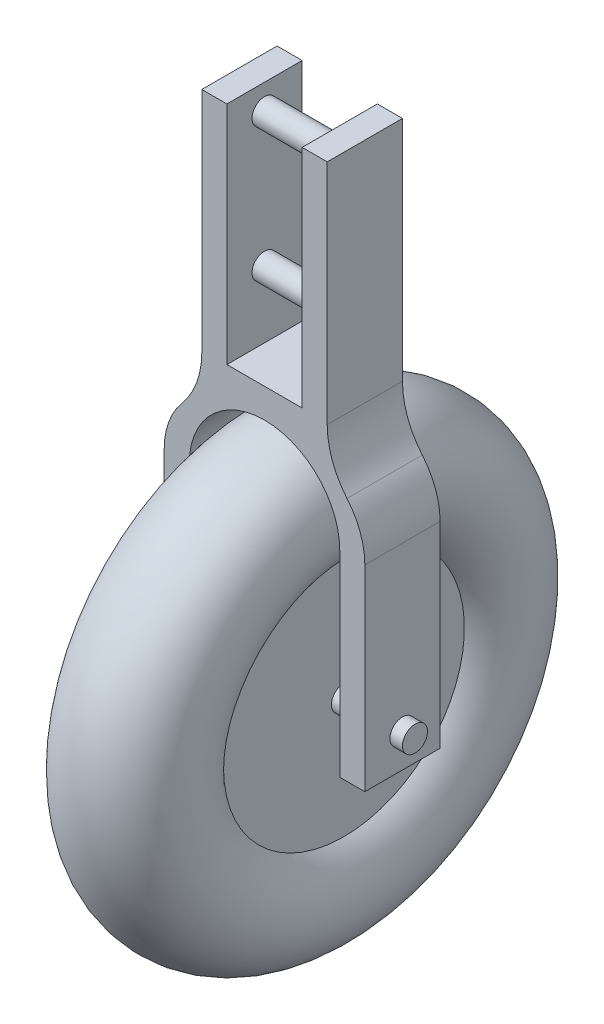
ISO-10303-21;
HEADER;
FILE_DESCRIPTION(('STEP AP214'),'2;1');
FILE_NAME('part.step','',(''),(''),'','','');
FILE_SCHEMA(('AUTOMOTIVE_DESIGN { 1 0 10303 214 1 1 1 1 }'));
ENDSEC;
DATA;
#1=APPLICATION_CONTEXT('core data for automotive mechanical design processes');
#2=APPLICATION_PROTOCOL_DEFINITION('international standard','automotive_design',2000,#1);
#3=PRODUCT_CONTEXT('',#1,'mechanical');
#4=PRODUCT('Part','Part','',(#3));
#5=PRODUCT_RELATED_PRODUCT_CATEGORY('part','',(#4));
#6=PRODUCT_DEFINITION_FORMATION('','',#4);
#7=PRODUCT_DEFINITION_CONTEXT('part definition',#1,'design');
#8=PRODUCT_DEFINITION('design','',#6,#7);
#9=PRODUCT_DEFINITION_SHAPE('','',#8);
#10=(LENGTH_UNIT() NAMED_UNIT(*) SI_UNIT(.MILLI.,.METRE.));
#11=(NAMED_UNIT(*) PLANE_ANGLE_UNIT() SI_UNIT($,.RADIAN.));
#12=(NAMED_UNIT(*) SI_UNIT($,.STERADIAN.) SOLID_ANGLE_UNIT());
#13=UNCERTAINTY_MEASURE_WITH_UNIT(LENGTH_MEASURE(1.E-05),#10,'distance_accuracy_value','');
#14=(GEOMETRIC_REPRESENTATION_CONTEXT(3) GLOBAL_UNCERTAINTY_ASSIGNED_CONTEXT((#13)) GLOBAL_UNIT_ASSIGNED_CONTEXT((#10,
#11,#12)) REPRESENTATION_CONTEXT('',''));
#15=CARTESIAN_POINT('',(0.,0.,0.));
#16=DIRECTION('',(0.,0.,1.));
#17=DIRECTION('',(1.,0.,0.));
#18=AXIS2_PLACEMENT_3D('',#15,#16,#17);
#19=CARTESIAN_POINT('',(13.5,-32.,4.5));
#20=DIRECTION('',(-1.,0.,0.));
#21=DIRECTION('',(0.,0.,1.));
#22=AXIS2_PLACEMENT_3D('',#19,#20,#21);
#23=CYLINDRICAL_SURFACE('',#22,1.5);
#24=CARTESIAN_POINT('',(9.,-32.,4.5));
#25=DIRECTION('',(1.,0.,0.));
#26=DIRECTION('',(0.,1.,0.));
#27=AXIS2_PLACEMENT_3D('',#24,#25,#26);
#28=CIRCLE('',#27,1.5);
#29=CARTESIAN_POINT('',(9.,-30.5,4.5));
#30=VERTEX_POINT('',#29);
#31=EDGE_CURVE('E279',#30,#30,#28,.F.);
#32=ORIENTED_EDGE('',*,*,#31,.T.);
#33=EDGE_LOOP('',(#32));
#34=FACE_BOUND('',#33,.T.);
#35=CARTESIAN_POINT('',(5.,-32.,4.5));
#36=DIRECTION('',(-1.,0.,0.));
#37=DIRECTION('',(0.,0.,1.));
#38=AXIS2_PLACEMENT_3D('',#35,#36,#37);
#39=CIRCLE('',#38,1.5);
#40=CARTESIAN_POINT('',(5.,-32.,6.));
#41=VERTEX_POINT('',#40);
#42=EDGE_CURVE('E11',#41,#41,#39,.T.);
#43=ORIENTED_EDGE('',*,*,#42,.F.);
#44=EDGE_LOOP('',(#43));
#45=FACE_BOUND('',#44,.T.);
#46=ADVANCED_FACE('F36',(#34,#45),#23,.T.);
#47=CARTESIAN_POINT('',(-7.5,27.,9.));
#48=DIRECTION('',(1.,0.,0.));
#49=DIRECTION('',(0.,1.,0.));
#50=AXIS2_PLACEMENT_3D('',#47,#48,#49);
#51=PLANE('',#50);
#52=DIRECTION('',(0.,-1.,0.));
#53=VECTOR('',#52,1.);
#54=CARTESIAN_POINT('',(-7.5,27.,0.));
#55=LINE('',#54,#53);
#56=CARTESIAN_POINT('',(-7.5,27.,0.));
#57=VERTEX_POINT('',#56);
#58=CARTESIAN_POINT('',(-7.5,-0.221970842191317,0.));
#59=VERTEX_POINT('',#58);
#60=EDGE_CURVE('E196',#57,#59,#55,.T.);
#61=ORIENTED_EDGE('',*,*,#60,.T.);
#62=DIRECTION('',(0.,0.,-1.));
#63=VECTOR('',#62,1.);
#64=CARTESIAN_POINT('',(-7.5,-0.221970842191317,9.));
#65=LINE('',#64,#63);
#66=CARTESIAN_POINT('',(-7.5,-0.221970842191317,9.));
#67=VERTEX_POINT('',#66);
#68=EDGE_CURVE('E275',#67,#59,#65,.T.);
#69=ORIENTED_EDGE('',*,*,#68,.F.);
#70=DIRECTION('',(0.,-1.,0.));
#71=VECTOR('',#70,1.);
#72=CARTESIAN_POINT('',(-7.5,27.,9.));
#73=LINE('',#72,#71);
#74=CARTESIAN_POINT('',(-7.5,27.,9.));
#75=VERTEX_POINT('',#74);
#76=EDGE_CURVE('E232',#75,#67,#73,.T.);
#77=ORIENTED_EDGE('',*,*,#76,.F.);
#78=DIRECTION('',(0.,0.,-1.));
#79=VECTOR('',#78,1.);
#80=CARTESIAN_POINT('',(-7.5,27.,9.));
#81=LINE('',#80,#79);
#82=EDGE_CURVE('E192',#75,#57,#81,.T.);
#83=ORIENTED_EDGE('',*,*,#82,.T.);
#84=EDGE_LOOP('',(#61,#69,#77,#83));
#85=FACE_BOUND('',#84,.T.);
#86=ADVANCED_FACE('F38',(#85),#51,.F.);
#87=CARTESIAN_POINT('',(-17.5,-0.221970842191319,9.));
#88=DIRECTION('',(0.,0.,-1.));
#89=DIRECTION('',(-1.,0.,0.));
#90=AXIS2_PLACEMENT_3D('',#87,#88,#89);
#91=CYLINDRICAL_SURFACE('',#90,10.);
#92=CARTESIAN_POINT('',(-17.5,-0.221970842191319,0.));
#93=DIRECTION('',(0.,0.,-1.));
#94=DIRECTION('',(-1.,0.,0.));
#95=AXIS2_PLACEMENT_3D('',#92,#93,#94);
#96=CIRCLE('',#95,10.);
#97=CARTESIAN_POINT('',(-9.86842105263158,-6.68409145156431,0.));
#98=VERTEX_POINT('',#97);
#99=EDGE_CURVE('E199',#59,#98,#96,.T.);
#100=ORIENTED_EDGE('',*,*,#99,.T.);
#101=DIRECTION('',(0.,0.,-1.));
#102=VECTOR('',#101,1.);
#103=CARTESIAN_POINT('',(-9.86842105263158,-6.68409145156431,9.));
#104=LINE('',#103,#102);
#105=CARTESIAN_POINT('',(-9.86842105263158,-6.68409145156431,9.));
#106=VERTEX_POINT('',#105);
#107=EDGE_CURVE('E272',#106,#98,#104,.T.);
#108=ORIENTED_EDGE('',*,*,#107,.F.);
#109=CARTESIAN_POINT('',(-17.5,-0.221970842191319,9.));
#110=DIRECTION('',(0.,0.,-1.));
#111=DIRECTION('',(-1.,0.,0.));
#112=AXIS2_PLACEMENT_3D('',#109,#110,#111);
#113=CIRCLE('',#112,10.);
#114=EDGE_CURVE('E129',#67,#106,#113,.T.);
#115=ORIENTED_EDGE('',*,*,#114,.F.);
#116=ORIENTED_EDGE('',*,*,#68,.T.);
#117=EDGE_LOOP('',(#100,#108,#115,#116));
#118=FACE_BOUND('',#117,.T.);
#119=ADVANCED_FACE('F376',(#118),#91,.F.);
#120=CARTESIAN_POINT('',(-3.,-12.5,9.));
#121=DIRECTION('',(0.,0.,-1.));
#122=DIRECTION('',(-1.,0.,0.));
#123=AXIS2_PLACEMENT_3D('',#120,#121,#122);
#124=CYLINDRICAL_SURFACE('',#123,9.);
#125=CARTESIAN_POINT('',(-3.,-12.5,0.));
#126=DIRECTION('',(0.,0.,1.));
#127=DIRECTION('',(-1.,0.,0.));
#128=AXIS2_PLACEMENT_3D('',#125,#126,#127);
#129=CIRCLE('',#128,9.);
#130=CARTESIAN_POINT('',(-12.,-12.5,0.));
#131=VERTEX_POINT('',#130);
#132=EDGE_CURVE('E202',#98,#131,#129,.T.);
#133=ORIENTED_EDGE('',*,*,#132,.T.);
#134=DIRECTION('',(0.,0.,-1.));
#135=VECTOR('',#134,1.);
#136=CARTESIAN_POINT('',(-12.,-12.5,9.));
#137=LINE('',#136,#135);
#138=CARTESIAN_POINT('',(-12.,-12.5,9.));
#139=VERTEX_POINT('',#138);
#140=EDGE_CURVE('E269',#139,#131,#137,.T.);
#141=ORIENTED_EDGE('',*,*,#140,.F.);
#142=CARTESIAN_POINT('',(-3.,-12.5,9.));
#143=DIRECTION('',(0.,0.,1.));
#144=DIRECTION('',(-1.,0.,0.));
#145=AXIS2_PLACEMENT_3D('',#142,#143,#144);
#146=CIRCLE('',#145,9.);
#147=EDGE_CURVE('E317',#106,#139,#146,.T.);
#148=ORIENTED_EDGE('',*,*,#147,.F.);
#149=ORIENTED_EDGE('',*,*,#107,.T.);
#150=EDGE_LOOP('',(#133,#141,#148,#149));
#151=FACE_BOUND('',#150,.T.);
#152=ADVANCED_FACE('F460',(#151),#124,.T.);
#153=CARTESIAN_POINT('',(-12.,-36.,9.));
#154=DIRECTION('',(1.,0.,0.));
#155=DIRECTION('',(0.,0.,-1.));
#156=AXIS2_PLACEMENT_3D('',#153,#154,#155);
#157=PLANE('',#156);
#158=CARTESIAN_POINT('',(-12.,-32.,4.5));
#159=DIRECTION('',(1.,0.,0.));
#160=DIRECTION('',(0.,0.,-1.));
#161=AXIS2_PLACEMENT_3D('',#158,#159,#160);
#162=CIRCLE('',#161,1.5);
#163=CARTESIAN_POINT('',(-12.,-32.,3.));
#164=VERTEX_POINT('',#163);
#165=EDGE_CURVE('E46',#164,#164,#162,.F.);
#166=ORIENTED_EDGE('',*,*,#165,.F.);
#167=EDGE_LOOP('',(#166));
#168=FACE_BOUND('',#167,.T.);
#169=DIRECTION('',(0.,-1.,0.));
#170=VECTOR('',#169,1.);
#171=CARTESIAN_POINT('',(-12.,-36.,0.));
#172=LINE('',#171,#170);
#173=CARTESIAN_POINT('',(-12.,-36.,0.));
#174=VERTEX_POINT('',#173);
#175=EDGE_CURVE('E204',#131,#174,#172,.T.);
#176=ORIENTED_EDGE('',*,*,#175,.T.);
#177=DIRECTION('',(0.,0.,-1.));
#178=VECTOR('',#177,1.);
#179=CARTESIAN_POINT('',(-12.,-36.,9.));
#180=LINE('',#179,#178);
#181=CARTESIAN_POINT('',(-12.,-36.,9.));
#182=VERTEX_POINT('',#181);
#183=EDGE_CURVE('E266',#182,#174,#180,.T.);
#184=ORIENTED_EDGE('',*,*,#183,.F.);
#185=DIRECTION('',(0.,-1.,0.));
#186=VECTOR('',#185,1.);
#187=CARTESIAN_POINT('',(-12.,-36.,9.));
#188=LINE('',#187,#186);
#189=EDGE_CURVE('E319',#139,#182,#188,.T.);
#190=ORIENTED_EDGE('',*,*,#189,.F.);
#191=ORIENTED_EDGE('',*,*,#140,.T.);
#192=EDGE_LOOP('',(#176,#184,#190,#191));
#193=FACE_BOUND('',#192,.T.);
#194=ADVANCED_FACE('F456',(#168,#193),#157,.F.);
#195=CARTESIAN_POINT('',(-12.,-36.,9.));
#196=DIRECTION('',(0.,1.,0.));
#197=DIRECTION('',(0.,0.,1.));
#198=AXIS2_PLACEMENT_3D('',#195,#196,#197);
#199=PLANE('',#198);
#200=DIRECTION('',(1.,0.,0.));
#201=VECTOR('',#200,1.);
#202=CARTESIAN_POINT('',(-12.,-36.,0.));
#203=LINE('',#202,#201);
#204=CARTESIAN_POINT('',(-9.,-36.,0.));
#205=VERTEX_POINT('',#204);
#206=EDGE_CURVE('E206',#174,#205,#203,.T.);
#207=ORIENTED_EDGE('',*,*,#206,.T.);
#208=DIRECTION('',(0.,0.,-1.));
#209=VECTOR('',#208,1.);
#210=CARTESIAN_POINT('',(-9.,-36.,9.));
#211=LINE('',#210,#209);
#212=CARTESIAN_POINT('',(-9.,-36.,9.));
#213=VERTEX_POINT('',#212);
#214=EDGE_CURVE('E263',#213,#205,#211,.T.);
#215=ORIENTED_EDGE('',*,*,#214,.F.);
#216=DIRECTION('',(1.,0.,0.));
#217=VECTOR('',#216,1.);
#218=CARTESIAN_POINT('',(-12.,-36.,9.));
#219=LINE('',#218,#217);
#220=EDGE_CURVE('E321',#182,#213,#219,.T.);
#221=ORIENTED_EDGE('',*,*,#220,.F.);
#222=ORIENTED_EDGE('',*,*,#183,.T.);
#223=EDGE_LOOP('',(#207,#215,#221,#222));
#224=FACE_BOUND('',#223,.T.);
#225=ADVANCED_FACE('F452',(#224),#199,.F.);
#226=CARTESIAN_POINT('',(-9.,-36.,9.));
#227=DIRECTION('',(-1.,0.,0.));
#228=DIRECTION('',(0.,-1.,0.));
#229=AXIS2_PLACEMENT_3D('',#226,#227,#228);
#230=PLANE('',#229);
#231=CARTESIAN_POINT('',(-9.,-32.,4.5));
#232=DIRECTION('',(-1.,0.,0.));
#233=DIRECTION('',(0.,-1.,0.));
#234=AXIS2_PLACEMENT_3D('',#231,#232,#233);
#235=CIRCLE('',#234,1.5);
#236=CARTESIAN_POINT('',(-9.,-33.5,4.5));
#237=VERTEX_POINT('',#236);
#238=EDGE_CURVE('E310',#237,#237,#235,.F.);
#239=ORIENTED_EDGE('',*,*,#238,.F.);
#240=EDGE_LOOP('',(#239));
#241=FACE_BOUND('',#240,.T.);
#242=DIRECTION('',(0.,1.,0.));
#243=VECTOR('',#242,1.);
#244=CARTESIAN_POINT('',(-9.,-36.,0.));
#245=LINE('',#244,#243);
#246=CARTESIAN_POINT('',(-9.,-12.5,0.));
#247=VERTEX_POINT('',#246);
#248=EDGE_CURVE('E208',#205,#247,#245,.T.);
#249=ORIENTED_EDGE('',*,*,#248,.T.);
#250=DIRECTION('',(0.,0.,-1.));
#251=VECTOR('',#250,1.);
#252=CARTESIAN_POINT('',(-9.,-12.5,9.));
#253=LINE('',#252,#251);
#254=CARTESIAN_POINT('',(-9.,-12.5,9.));
#255=VERTEX_POINT('',#254);
#256=EDGE_CURVE('E260',#255,#247,#253,.T.);
#257=ORIENTED_EDGE('',*,*,#256,.F.);
#258=DIRECTION('',(0.,1.,0.));
#259=VECTOR('',#258,1.);
#260=CARTESIAN_POINT('',(-9.,-36.,9.));
#261=LINE('',#260,#259);
#262=EDGE_CURVE('E323',#213,#255,#261,.T.);
#263=ORIENTED_EDGE('',*,*,#262,.F.);
#264=ORIENTED_EDGE('',*,*,#214,.T.);
#265=EDGE_LOOP('',(#249,#257,#263,#264));
#266=FACE_BOUND('',#265,.T.);
#267=ADVANCED_FACE('F448',(#241,#266),#230,.F.);
#268=CARTESIAN_POINT('',(0.,-12.5,9.));
#269=DIRECTION('',(0.,0.,-1.));
#270=DIRECTION('',(-1.,0.,0.));
#271=AXIS2_PLACEMENT_3D('',#268,#269,#270);
#272=CYLINDRICAL_SURFACE('',#271,9.);
#273=CARTESIAN_POINT('',(0.,-12.5,0.));
#274=DIRECTION('',(0.,0.,-1.));
#275=DIRECTION('',(1.,0.,0.));
#276=AXIS2_PLACEMENT_3D('',#273,#274,#275);
#277=CIRCLE('',#276,9.);
#278=CARTESIAN_POINT('',(9.,-12.5,0.));
#279=VERTEX_POINT('',#278);
#280=EDGE_CURVE('E211',#247,#279,#277,.T.);
#281=ORIENTED_EDGE('',*,*,#280,.T.);
#282=DIRECTION('',(0.,0.,-1.));
#283=VECTOR('',#282,1.);
#284=CARTESIAN_POINT('',(9.,-12.5,9.));
#285=LINE('',#284,#283);
#286=CARTESIAN_POINT('',(9.,-12.5,9.));
#287=VERTEX_POINT('',#286);
#288=EDGE_CURVE('E257',#287,#279,#285,.T.);
#289=ORIENTED_EDGE('',*,*,#288,.F.);
#290=CARTESIAN_POINT('',(0.,-12.5,9.));
#291=DIRECTION('',(0.,0.,-1.));
#292=DIRECTION('',(-1.,0.,0.));
#293=AXIS2_PLACEMENT_3D('',#290,#291,#292);
#294=CIRCLE('',#293,9.);
#295=EDGE_CURVE('E325',#255,#287,#294,.T.);
#296=ORIENTED_EDGE('',*,*,#295,.F.);
#297=ORIENTED_EDGE('',*,*,#256,.T.);
#298=EDGE_LOOP('',(#281,#289,#296,#297));
#299=FACE_BOUND('',#298,.T.);
#300=ADVANCED_FACE('F444',(#299),#272,.F.);
#301=CARTESIAN_POINT('',(9.,-36.,9.));
#302=DIRECTION('',(1.,0.,0.));
#303=DIRECTION('',(0.,1.,0.));
#304=AXIS2_PLACEMENT_3D('',#301,#302,#303);
#305=PLANE('',#304);
#306=ORIENTED_EDGE('',*,*,#31,.F.);
#307=EDGE_LOOP('',(#306));
#308=FACE_BOUND('',#307,.T.);
#309=DIRECTION('',(0.,-1.,0.));
#310=VECTOR('',#309,1.);
#311=CARTESIAN_POINT('',(9.,-36.,0.));
#312=LINE('',#311,#310);
#313=CARTESIAN_POINT('',(9.,-36.,0.));
#314=VERTEX_POINT('',#313);
#315=EDGE_CURVE('E213',#279,#314,#312,.T.);
#316=ORIENTED_EDGE('',*,*,#315,.T.);
#317=DIRECTION('',(0.,0.,-1.));
#318=VECTOR('',#317,1.);
#319=CARTESIAN_POINT('',(9.,-36.,9.));
#320=LINE('',#319,#318);
#321=CARTESIAN_POINT('',(9.,-36.,9.));
#322=VERTEX_POINT('',#321);
#323=EDGE_CURVE('E254',#322,#314,#320,.T.);
#324=ORIENTED_EDGE('',*,*,#323,.F.);
#325=DIRECTION('',(0.,-1.,0.));
#326=VECTOR('',#325,1.);
#327=CARTESIAN_POINT('',(9.,-36.,9.));
#328=LINE('',#327,#326);
#329=EDGE_CURVE('E327',#287,#322,#328,.T.);
#330=ORIENTED_EDGE('',*,*,#329,.F.);
#331=ORIENTED_EDGE('',*,*,#288,.T.);
#332=EDGE_LOOP('',(#316,#324,#330,#331));
#333=FACE_BOUND('',#332,.T.);
#334=ADVANCED_FACE('F440',(#308,#333),#305,.F.);
#335=CARTESIAN_POINT('',(12.,-36.,9.));
#336=DIRECTION('',(0.,1.,0.));
#337=DIRECTION('',(0.,0.,1.));
#338=AXIS2_PLACEMENT_3D('',#335,#336,#337);
#339=PLANE('',#338);
#340=DIRECTION('',(1.,0.,0.));
#341=VECTOR('',#340,1.);
#342=CARTESIAN_POINT('',(12.,-36.,0.));
#343=LINE('',#342,#341);
#344=CARTESIAN_POINT('',(12.,-36.,0.));
#345=VERTEX_POINT('',#344);
#346=EDGE_CURVE('E215',#314,#345,#343,.T.);
#347=ORIENTED_EDGE('',*,*,#346,.T.);
#348=DIRECTION('',(0.,0.,-1.));
#349=VECTOR('',#348,1.);
#350=CARTESIAN_POINT('',(12.,-36.,9.));
#351=LINE('',#350,#349);
#352=CARTESIAN_POINT('',(12.,-36.,9.));
#353=VERTEX_POINT('',#352);
#354=EDGE_CURVE('E251',#353,#345,#351,.T.);
#355=ORIENTED_EDGE('',*,*,#354,.F.);
#356=DIRECTION('',(1.,0.,0.));
#357=VECTOR('',#356,1.);
#358=CARTESIAN_POINT('',(12.,-36.,9.));
#359=LINE('',#358,#357);
#360=EDGE_CURVE('E329',#322,#353,#359,.T.);
#361=ORIENTED_EDGE('',*,*,#360,.F.);
#362=ORIENTED_EDGE('',*,*,#323,.T.);
#363=EDGE_LOOP('',(#347,#355,#361,#362));
#364=FACE_BOUND('',#363,.T.);
#365=ADVANCED_FACE('F407',(#364),#339,.F.);
#366=CARTESIAN_POINT('',(12.,-36.,9.));
#367=DIRECTION('',(-1.,0.,0.));
#368=DIRECTION('',(0.,0.,1.));
#369=AXIS2_PLACEMENT_3D('',#366,#367,#368);
#370=PLANE('',#369);
#371=CARTESIAN_POINT('',(12.,-32.,4.5));
#372=DIRECTION('',(-1.,0.,0.));
#373=DIRECTION('',(0.,0.,1.));
#374=AXIS2_PLACEMENT_3D('',#371,#372,#373);
#375=CIRCLE('',#374,1.5);
#376=CARTESIAN_POINT('',(12.,-32.,6.));
#377=VERTEX_POINT('',#376);
#378=EDGE_CURVE('E277',#377,#377,#375,.F.);
#379=ORIENTED_EDGE('',*,*,#378,.F.);
#380=EDGE_LOOP('',(#379));
#381=FACE_BOUND('',#380,.T.);
#382=DIRECTION('',(0.,1.,0.));
#383=VECTOR('',#382,1.);
#384=CARTESIAN_POINT('',(12.,-36.,0.));
#385=LINE('',#384,#383);
#386=CARTESIAN_POINT('',(12.,-12.5,0.));
#387=VERTEX_POINT('',#386);
#388=EDGE_CURVE('E217',#345,#387,#385,.T.);
#389=ORIENTED_EDGE('',*,*,#388,.T.);
#390=DIRECTION('',(0.,0.,-1.));
#391=VECTOR('',#390,1.);
#392=CARTESIAN_POINT('',(12.,-12.5,9.));
#393=LINE('',#392,#391);
#394=CARTESIAN_POINT('',(12.,-12.5,9.));
#395=VERTEX_POINT('',#394);
#396=EDGE_CURVE('E248',#395,#387,#393,.T.);
#397=ORIENTED_EDGE('',*,*,#396,.F.);
#398=DIRECTION('',(0.,1.,0.));
#399=VECTOR('',#398,1.);
#400=CARTESIAN_POINT('',(12.,-36.,9.));
#401=LINE('',#400,#399);
#402=EDGE_CURVE('E331',#353,#395,#401,.T.);
#403=ORIENTED_EDGE('',*,*,#402,.F.);
#404=ORIENTED_EDGE('',*,*,#354,.T.);
#405=EDGE_LOOP('',(#389,#397,#403,#404));
#406=FACE_BOUND('',#405,.T.);
#407=ADVANCED_FACE('F403',(#381,#406),#370,.F.);
#408=CARTESIAN_POINT('',(3.,-12.5,9.));
#409=DIRECTION('',(0.,0.,-1.));
#410=DIRECTION('',(-1.,0.,0.));
#411=AXIS2_PLACEMENT_3D('',#408,#409,#410);
#412=CYLINDRICAL_SURFACE('',#411,9.);
#413=CARTESIAN_POINT('',(3.,-12.5,0.));
#414=DIRECTION('',(0.,0.,1.));
#415=DIRECTION('',(1.,0.,0.));
#416=AXIS2_PLACEMENT_3D('',#413,#414,#415);
#417=CIRCLE('',#416,9.);
#418=CARTESIAN_POINT('',(9.86842105263158,-6.68409145156431,0.));
#419=VERTEX_POINT('',#418);
#420=EDGE_CURVE('E219',#387,#419,#417,.T.);
#421=ORIENTED_EDGE('',*,*,#420,.T.);
#422=DIRECTION('',(0.,0.,-1.));
#423=VECTOR('',#422,1.);
#424=CARTESIAN_POINT('',(9.86842105263158,-6.68409145156431,9.));
#425=LINE('',#424,#423);
#426=CARTESIAN_POINT('',(9.86842105263158,-6.68409145156431,9.));
#427=VERTEX_POINT('',#426);
#428=EDGE_CURVE('E245',#427,#419,#425,.T.);
#429=ORIENTED_EDGE('',*,*,#428,.F.);
#430=CARTESIAN_POINT('',(3.,-12.5,9.));
#431=DIRECTION('',(0.,0.,1.));
#432=DIRECTION('',(1.,0.,0.));
#433=AXIS2_PLACEMENT_3D('',#430,#431,#432);
#434=CIRCLE('',#433,9.);
#435=EDGE_CURVE('E333',#395,#427,#434,.T.);
#436=ORIENTED_EDGE('',*,*,#435,.F.);
#437=ORIENTED_EDGE('',*,*,#396,.T.);
#438=EDGE_LOOP('',(#421,#429,#436,#437));
#439=FACE_BOUND('',#438,.T.);
#440=ADVANCED_FACE('F406',(#439),#412,.T.);
#441=CARTESIAN_POINT('',(17.5,-0.221970842191319,9.));
#442=DIRECTION('',(0.,0.,-1.));
#443=DIRECTION('',(-1.,0.,0.));
#444=AXIS2_PLACEMENT_3D('',#441,#442,#443);
#445=CYLINDRICAL_SURFACE('',#444,10.);
#446=CARTESIAN_POINT('',(17.5,-0.221970842191319,0.));
#447=DIRECTION('',(0.,0.,-1.));
#448=DIRECTION('',(1.,0.,0.));
#449=AXIS2_PLACEMENT_3D('',#446,#447,#448);
#450=CIRCLE('',#449,10.);
#451=CARTESIAN_POINT('',(7.5,-0.221970842191317,0.));
#452=VERTEX_POINT('',#451);
#453=EDGE_CURVE('E221',#419,#452,#450,.T.);
#454=ORIENTED_EDGE('',*,*,#453,.T.);
#455=DIRECTION('',(0.,0.,-1.));
#456=VECTOR('',#455,1.);
#457=CARTESIAN_POINT('',(7.5,-0.221970842191317,9.));
#458=LINE('',#457,#456);
#459=CARTESIAN_POINT('',(7.5,-0.221970842191317,9.));
#460=VERTEX_POINT('',#459);
#461=EDGE_CURVE('E242',#460,#452,#458,.T.);
#462=ORIENTED_EDGE('',*,*,#461,.F.);
#463=CARTESIAN_POINT('',(17.5,-0.221970842191319,9.));
#464=DIRECTION('',(0.,0.,-1.));
#465=DIRECTION('',(1.,0.,0.));
#466=AXIS2_PLACEMENT_3D('',#463,#464,#465);
#467=CIRCLE('',#466,10.);
#468=EDGE_CURVE('E335',#427,#460,#467,.T.);
#469=ORIENTED_EDGE('',*,*,#468,.F.);
#470=ORIENTED_EDGE('',*,*,#428,.T.);
#471=EDGE_LOOP('',(#454,#462,#469,#470));
#472=FACE_BOUND('',#471,.T.);
#473=ADVANCED_FACE('F422',(#472),#445,.F.);
#474=CARTESIAN_POINT('',(7.5,27.,9.));
#475=DIRECTION('',(-1.,0.,0.));
#476=DIRECTION('',(0.,-1.,0.));
#477=AXIS2_PLACEMENT_3D('',#474,#475,#476);
#478=PLANE('',#477);
#479=DIRECTION('',(0.,1.,0.));
#480=VECTOR('',#479,1.);
#481=CARTESIAN_POINT('',(7.5,27.,0.));
#482=LINE('',#481,#480);
#483=CARTESIAN_POINT('',(7.5,27.,0.));
#484=VERTEX_POINT('',#483);
#485=EDGE_CURVE('E223',#452,#484,#482,.T.);
#486=ORIENTED_EDGE('',*,*,#485,.T.);
#487=DIRECTION('',(0.,0.,-1.));
#488=VECTOR('',#487,1.);
#489=CARTESIAN_POINT('',(7.5,27.,9.));
#490=LINE('',#489,#488);
#491=CARTESIAN_POINT('',(7.5,27.,9.));
#492=VERTEX_POINT('',#491);
#493=EDGE_CURVE('E239',#492,#484,#490,.T.);
#494=ORIENTED_EDGE('',*,*,#493,.F.);
#495=DIRECTION('',(0.,1.,0.));
#496=VECTOR('',#495,1.);
#497=CARTESIAN_POINT('',(7.5,27.,9.));
#498=LINE('',#497,#496);
#499=EDGE_CURVE('E337',#460,#492,#498,.T.);
#500=ORIENTED_EDGE('',*,*,#499,.F.);
#501=ORIENTED_EDGE('',*,*,#461,.T.);
#502=EDGE_LOOP('',(#486,#494,#500,#501));
#503=FACE_BOUND('',#502,.T.);
#504=ADVANCED_FACE('F425',(#503),#478,.F.);
#505=CARTESIAN_POINT('',(7.5,27.,9.));
#506=DIRECTION('',(0.,-1.,0.));
#507=DIRECTION('',(1.,0.,0.));
#508=AXIS2_PLACEMENT_3D('',#505,#506,#507);
#509=PLANE('',#508);
#510=DIRECTION('',(-1.,0.,0.));
#511=VECTOR('',#510,1.);
#512=CARTESIAN_POINT('',(7.5,27.,0.));
#513=LINE('',#512,#511);
#514=CARTESIAN_POINT('',(4.5,27.,0.));
#515=VERTEX_POINT('',#514);
#516=EDGE_CURVE('E225',#484,#515,#513,.T.);
#517=ORIENTED_EDGE('',*,*,#516,.T.);
#518=DIRECTION('',(0.,0.,-1.));
#519=VECTOR('',#518,1.);
#520=CARTESIAN_POINT('',(4.5,27.,9.));
#521=LINE('',#520,#519);
#522=CARTESIAN_POINT('',(4.5,27.,9.));
#523=VERTEX_POINT('',#522);
#524=EDGE_CURVE('E236',#523,#515,#521,.T.);
#525=ORIENTED_EDGE('',*,*,#524,.F.);
#526=DIRECTION('',(-1.,0.,0.));
#527=VECTOR('',#526,1.);
#528=CARTESIAN_POINT('',(7.5,27.,9.));
#529=LINE('',#528,#527);
#530=EDGE_CURVE('E339',#492,#523,#529,.T.);
#531=ORIENTED_EDGE('',*,*,#530,.F.);
#532=ORIENTED_EDGE('',*,*,#493,.T.);
#533=EDGE_LOOP('',(#517,#525,#531,#532));
#534=FACE_BOUND('',#533,.T.);
#535=ADVANCED_FACE('F345',(#534),#509,.F.);
#536=CARTESIAN_POINT('',(4.5,27.,9.));
#537=DIRECTION('',(1.,0.,0.));
#538=DIRECTION('',(0.,1.,0.));
#539=AXIS2_PLACEMENT_3D('',#536,#537,#538);
#540=PLANE('',#539);
#541=CARTESIAN_POINT('',(4.5,7.99999999999999,4.5));
#542=DIRECTION('',(1.,0.,0.));
#543=DIRECTION('',(0.,1.,0.));
#544=AXIS2_PLACEMENT_3D('',#541,#542,#543);
#545=CIRCLE('',#544,1.5);
#546=CARTESIAN_POINT('',(4.5,9.49999999999999,4.5));
#547=VERTEX_POINT('',#546);
#548=EDGE_CURVE('E288',#547,#547,#545,.T.);
#549=ORIENTED_EDGE('',*,*,#548,.T.);
#550=EDGE_LOOP('',(#549));
#551=FACE_BOUND('',#550,.T.);
#552=CARTESIAN_POINT('',(4.5,24.,4.5));
#553=DIRECTION('',(1.,0.,0.));
#554=DIRECTION('',(0.,1.,0.));
#555=AXIS2_PLACEMENT_3D('',#552,#553,#554);
#556=CIRCLE('',#555,1.5);
#557=CARTESIAN_POINT('',(4.5,25.5,4.5));
#558=VERTEX_POINT('',#557);
#559=EDGE_CURVE('E287',#558,#558,#556,.T.);
#560=ORIENTED_EDGE('',*,*,#559,.T.);
#561=EDGE_LOOP('',(#560));
#562=FACE_BOUND('',#561,.T.);
#563=DIRECTION('',(0.,-1.,0.));
#564=VECTOR('',#563,1.);
#565=CARTESIAN_POINT('',(4.5,27.,0.));
#566=LINE('',#565,#564);
#567=CARTESIAN_POINT('',(4.5,0.,0.));
#568=VERTEX_POINT('',#567);
#569=EDGE_CURVE('E227',#515,#568,#566,.T.);
#570=ORIENTED_EDGE('',*,*,#569,.T.);
#571=DIRECTION('',(0.,0.,-1.));
#572=VECTOR('',#571,1.);
#573=CARTESIAN_POINT('',(4.5,0.,9.));
#574=LINE('',#573,#572);
#575=CARTESIAN_POINT('',(4.5,0.,9.));
#576=VERTEX_POINT('',#575);
#577=EDGE_CURVE('E187',#576,#568,#574,.T.);
#578=ORIENTED_EDGE('',*,*,#577,.F.);
#579=DIRECTION('',(0.,-1.,0.));
#580=VECTOR('',#579,1.);
#581=CARTESIAN_POINT('',(4.5,27.,9.));
#582=LINE('',#581,#580);
#583=EDGE_CURVE('E178',#523,#576,#582,.T.);
#584=ORIENTED_EDGE('',*,*,#583,.F.);
#585=ORIENTED_EDGE('',*,*,#524,.T.);
#586=EDGE_LOOP('',(#570,#578,#584,#585));
#587=FACE_BOUND('',#586,.T.);
#588=ADVANCED_FACE('F349',(#551,#562,#587),#540,.F.);
#589=CARTESIAN_POINT('',(-4.5,0.,9.));
#590=DIRECTION('',(0.,-1.,0.));
#591=DIRECTION('',(0.,0.,-1.));
#592=AXIS2_PLACEMENT_3D('',#589,#590,#591);
#593=PLANE('',#592);
#594=DIRECTION('',(-1.,0.,0.));
#595=VECTOR('',#594,1.);
#596=CARTESIAN_POINT('',(-4.5,0.,0.));
#597=LINE('',#596,#595);
#598=CARTESIAN_POINT('',(-4.5,0.,0.));
#599=VERTEX_POINT('',#598);
#600=EDGE_CURVE('E186',#568,#599,#597,.T.);
#601=ORIENTED_EDGE('',*,*,#600,.T.);
#602=DIRECTION('',(0.,0.,-1.));
#603=VECTOR('',#602,1.);
#604=CARTESIAN_POINT('',(-4.5,0.,9.));
#605=LINE('',#604,#603);
#606=CARTESIAN_POINT('',(-4.5,0.,9.));
#607=VERTEX_POINT('',#606);
#608=EDGE_CURVE('E183',#607,#599,#605,.T.);
#609=ORIENTED_EDGE('',*,*,#608,.F.);
#610=DIRECTION('',(-1.,0.,0.));
#611=VECTOR('',#610,1.);
#612=CARTESIAN_POINT('',(-4.5,0.,9.));
#613=LINE('',#612,#611);
#614=EDGE_CURVE('E172',#576,#607,#613,.T.);
#615=ORIENTED_EDGE('',*,*,#614,.F.);
#616=ORIENTED_EDGE('',*,*,#577,.T.);
#617=EDGE_LOOP('',(#601,#609,#615,#616));
#618=FACE_BOUND('',#617,.T.);
#619=ADVANCED_FACE('F184',(#618),#593,.F.);
#620=CARTESIAN_POINT('',(-4.5,27.,9.));
#621=DIRECTION('',(-1.,0.,0.));
#622=DIRECTION('',(0.,-1.,0.));
#623=AXIS2_PLACEMENT_3D('',#620,#621,#622);
#624=PLANE('',#623);
#625=CARTESIAN_POINT('',(-4.5,8.,4.5));
#626=DIRECTION('',(-1.,0.,0.));
#627=DIRECTION('',(0.,-1.,0.));
#628=AXIS2_PLACEMENT_3D('',#625,#626,#627);
#629=CIRCLE('',#628,1.5);
#630=CARTESIAN_POINT('',(-4.5,6.5,4.5));
#631=VERTEX_POINT('',#630);
#632=EDGE_CURVE('E40',#631,#631,#629,.T.);
#633=ORIENTED_EDGE('',*,*,#632,.T.);
#634=EDGE_LOOP('',(#633));
#635=FACE_BOUND('',#634,.T.);
#636=CARTESIAN_POINT('',(-4.5,24.,4.5));
#637=DIRECTION('',(-1.,0.,0.));
#638=DIRECTION('',(0.,-1.,0.));
#639=AXIS2_PLACEMENT_3D('',#636,#637,#638);
#640=CIRCLE('',#639,1.5);
#641=CARTESIAN_POINT('',(-4.5,22.5,4.5));
#642=VERTEX_POINT('',#641);
#643=EDGE_CURVE('E285',#642,#642,#640,.T.);
#644=ORIENTED_EDGE('',*,*,#643,.T.);
#645=EDGE_LOOP('',(#644));
#646=FACE_BOUND('',#645,.T.);
#647=DIRECTION('',(0.,1.,0.));
#648=VECTOR('',#647,1.);
#649=CARTESIAN_POINT('',(-4.5,27.,0.));
#650=LINE('',#649,#648);
#651=CARTESIAN_POINT('',(-4.5,27.,0.));
#652=VERTEX_POINT('',#651);
#653=EDGE_CURVE('E114',#599,#652,#650,.T.);
#654=ORIENTED_EDGE('',*,*,#653,.T.);
#655=DIRECTION('',(0.,0.,-1.));
#656=VECTOR('',#655,1.);
#657=CARTESIAN_POINT('',(-4.5,27.,9.));
#658=LINE('',#657,#656);
#659=CARTESIAN_POINT('',(-4.5,27.,9.));
#660=VERTEX_POINT('',#659);
#661=EDGE_CURVE('E188',#660,#652,#658,.T.);
#662=ORIENTED_EDGE('',*,*,#661,.F.);
#663=DIRECTION('',(0.,1.,0.));
#664=VECTOR('',#663,1.);
#665=CARTESIAN_POINT('',(-4.5,27.,9.));
#666=LINE('',#665,#664);
#667=EDGE_CURVE('E176',#607,#660,#666,.T.);
#668=ORIENTED_EDGE('',*,*,#667,.F.);
#669=ORIENTED_EDGE('',*,*,#608,.T.);
#670=EDGE_LOOP('',(#654,#662,#668,#669));
#671=FACE_BOUND('',#670,.T.);
#672=ADVANCED_FACE('F190',(#635,#646,#671),#624,.F.);
#673=CARTESIAN_POINT('',(-7.5,27.,9.));
#674=DIRECTION('',(0.,-1.,0.));
#675=DIRECTION('',(1.,0.,0.));
#676=AXIS2_PLACEMENT_3D('',#673,#674,#675);
#677=PLANE('',#676);
#678=DIRECTION('',(-1.,0.,0.));
#679=VECTOR('',#678,1.);
#680=CARTESIAN_POINT('',(-7.5,27.,0.));
#681=LINE('',#680,#679);
#682=EDGE_CURVE('E120',#652,#57,#681,.T.);
#683=ORIENTED_EDGE('',*,*,#682,.T.);
#684=ORIENTED_EDGE('',*,*,#82,.F.);
#685=DIRECTION('',(-1.,0.,0.));
#686=VECTOR('',#685,1.);
#687=CARTESIAN_POINT('',(-7.5,27.,9.));
#688=LINE('',#687,#686);
#689=EDGE_CURVE('E55',#660,#75,#688,.T.);
#690=ORIENTED_EDGE('',*,*,#689,.F.);
#691=ORIENTED_EDGE('',*,*,#661,.T.);
#692=EDGE_LOOP('',(#683,#684,#690,#691));
#693=FACE_BOUND('',#692,.T.);
#694=ADVANCED_FACE('F357',(#693),#677,.F.);
#695=CARTESIAN_POINT('',(-17.5,-0.221970842191319,9.));
#696=DIRECTION('',(0.,0.,-1.));
#697=DIRECTION('',(-1.,0.,0.));
#698=AXIS2_PLACEMENT_3D('',#695,#696,#697);
#699=PLANE('',#698);
#700=ORIENTED_EDGE('',*,*,#76,.T.);
#701=ORIENTED_EDGE('',*,*,#114,.T.);
#702=ORIENTED_EDGE('',*,*,#147,.T.);
#703=ORIENTED_EDGE('',*,*,#189,.T.);
#704=ORIENTED_EDGE('',*,*,#220,.T.);
#705=ORIENTED_EDGE('',*,*,#262,.T.);
#706=ORIENTED_EDGE('',*,*,#295,.T.);
#707=ORIENTED_EDGE('',*,*,#329,.T.);
#708=ORIENTED_EDGE('',*,*,#360,.T.);
#709=ORIENTED_EDGE('',*,*,#402,.T.);
#710=ORIENTED_EDGE('',*,*,#435,.T.);
#711=ORIENTED_EDGE('',*,*,#468,.T.);
#712=ORIENTED_EDGE('',*,*,#499,.T.);
#713=ORIENTED_EDGE('',*,*,#530,.T.);
#714=ORIENTED_EDGE('',*,*,#583,.T.);
#715=ORIENTED_EDGE('',*,*,#614,.T.);
#716=ORIENTED_EDGE('',*,*,#667,.T.);
#717=ORIENTED_EDGE('',*,*,#689,.T.);
#718=EDGE_LOOP('',(#700,#701,#702,#703,#704,#705,#706,#707,#708,#709,#710,#711,#712,#713,#714,
#715,#716,#717));
#719=FACE_BOUND('',#718,.T.);
#720=ADVANCED_FACE('F174',(#719),#699,.F.);
#721=CARTESIAN_POINT('',(-17.5,-0.221970842191319,0.));
#722=DIRECTION('',(0.,0.,-1.));
#723=DIRECTION('',(-1.,0.,0.));
#724=AXIS2_PLACEMENT_3D('',#721,#722,#723);
#725=PLANE('',#724);
#726=ORIENTED_EDGE('',*,*,#60,.F.);
#727=ORIENTED_EDGE('',*,*,#682,.F.);
#728=ORIENTED_EDGE('',*,*,#653,.F.);
#729=ORIENTED_EDGE('',*,*,#600,.F.);
#730=ORIENTED_EDGE('',*,*,#569,.F.);
#731=ORIENTED_EDGE('',*,*,#516,.F.);
#732=ORIENTED_EDGE('',*,*,#485,.F.);
#733=ORIENTED_EDGE('',*,*,#453,.F.);
#734=ORIENTED_EDGE('',*,*,#420,.F.);
#735=ORIENTED_EDGE('',*,*,#388,.F.);
#736=ORIENTED_EDGE('',*,*,#346,.F.);
#737=ORIENTED_EDGE('',*,*,#315,.F.);
#738=ORIENTED_EDGE('',*,*,#280,.F.);
#739=ORIENTED_EDGE('',*,*,#248,.F.);
#740=ORIENTED_EDGE('',*,*,#206,.F.);
#741=ORIENTED_EDGE('',*,*,#175,.F.);
#742=ORIENTED_EDGE('',*,*,#132,.F.);
#743=ORIENTED_EDGE('',*,*,#99,.F.);
#744=EDGE_LOOP('',(#726,#727,#728,#729,#730,#731,#732,#733,#734,#735,#736,#737,#738,#739,#740,
#741,#742,#743));
#745=FACE_BOUND('',#744,.T.);
#746=ADVANCED_FACE('F352',(#745),#725,.T.);
#747=CARTESIAN_POINT('',(13.5,-32.,4.5));
#748=DIRECTION('',(1.,0.,0.));
#749=DIRECTION('',(0.,0.,-1.));
#750=AXIS2_PLACEMENT_3D('',#747,#748,#749);
#751=PLANE('',#750);
#752=CARTESIAN_POINT('',(13.5,-32.,4.5));
#753=DIRECTION('',(1.,0.,0.));
#754=DIRECTION('',(0.,0.,-1.));
#755=AXIS2_PLACEMENT_3D('',#752,#753,#754);
#756=CIRCLE('',#755,1.5);
#757=CARTESIAN_POINT('',(13.5,-32.,3.));
#758=VERTEX_POINT('',#757);
#759=EDGE_CURVE('E200',#758,#758,#756,.T.);
#760=ORIENTED_EDGE('',*,*,#759,.T.);
#761=EDGE_LOOP('',(#760));
#762=FACE_BOUND('',#761,.T.);
#763=ADVANCED_FACE('F392',(#762),#751,.T.);
#764=ORIENTED_EDGE('',*,*,#759,.F.);
#765=EDGE_LOOP('',(#764));
#766=FACE_BOUND('',#765,.T.);
#767=ORIENTED_EDGE('',*,*,#378,.T.);
#768=EDGE_LOOP('',(#767));
#769=FACE_BOUND('',#768,.T.);
#770=ADVANCED_FACE('F380',(#766,#769),#23,.T.);
#771=CARTESIAN_POINT('',(-5.,-32.,4.5));
#772=DIRECTION('',(-1.,0.,0.));
#773=DIRECTION('',(0.,0.,1.));
#774=AXIS2_PLACEMENT_3D('',#771,#772,#773);
#775=CIRCLE('',#774,1.5);
#776=CARTESIAN_POINT('',(-5.,-32.,6.));
#777=VERTEX_POINT('',#776);
#778=EDGE_CURVE('E281',#777,#777,#775,.T.);
#779=ORIENTED_EDGE('',*,*,#778,.T.);
#780=EDGE_LOOP('',(#779));
#781=FACE_BOUND('',#780,.T.);
#782=ORIENTED_EDGE('',*,*,#238,.T.);
#783=EDGE_LOOP('',(#782));
#784=FACE_BOUND('',#783,.T.);
#785=ADVANCED_FACE('F371',(#781,#784),#23,.T.);
#786=CARTESIAN_POINT('',(-13.5,-32.,4.5));
#787=DIRECTION('',(1.,0.,0.));
#788=DIRECTION('',(0.,0.,-1.));
#789=AXIS2_PLACEMENT_3D('',#786,#787,#788);
#790=CIRCLE('',#789,1.5);
#791=CARTESIAN_POINT('',(-13.5,-32.,3.));
#792=VERTEX_POINT('',#791);
#793=EDGE_CURVE('E283',#792,#792,#790,.T.);
#794=ORIENTED_EDGE('',*,*,#793,.T.);
#795=EDGE_LOOP('',(#794));
#796=FACE_BOUND('',#795,.T.);
#797=ORIENTED_EDGE('',*,*,#165,.T.);
#798=EDGE_LOOP('',(#797));
#799=FACE_BOUND('',#798,.T.);
#800=ADVANCED_FACE('F372',(#796,#799),#23,.T.);
#801=CARTESIAN_POINT('',(-13.5,-32.,4.5));
#802=DIRECTION('',(1.,0.,0.));
#803=DIRECTION('',(0.,0.,-1.));
#804=AXIS2_PLACEMENT_3D('',#801,#802,#803);
#805=PLANE('',#804);
#806=ORIENTED_EDGE('',*,*,#793,.F.);
#807=EDGE_LOOP('',(#806));
#808=FACE_BOUND('',#807,.T.);
#809=ADVANCED_FACE('F383',(#808),#805,.F.);
#810=CARTESIAN_POINT('',(-5.,-32.,4.5));
#811=DIRECTION('',(-1.,0.,0.));
#812=DIRECTION('',(0.,0.,1.));
#813=AXIS2_PLACEMENT_3D('',#810,#811,#812);
#814=PLANE('',#813);
#815=ORIENTED_EDGE('',*,*,#778,.F.);
#816=EDGE_LOOP('',(#815));
#817=FACE_BOUND('',#816,.T.);
#818=CARTESIAN_POINT('',(-5.,-32.,4.5));
#819=DIRECTION('',(-1.,0.,0.));
#820=DIRECTION('',(0.,0.,1.));
#821=AXIS2_PLACEMENT_3D('',#818,#819,#820);
#822=CIRCLE('',#821,14.4098300562505);
#823=CARTESIAN_POINT('',(-5.,-32.,18.9098300562505));
#824=VERTEX_POINT('',#823);
#825=EDGE_CURVE('E292',#824,#824,#822,.T.);
#826=ORIENTED_EDGE('',*,*,#825,.T.);
#827=EDGE_LOOP('',(#826));
#828=FACE_BOUND('',#827,.T.);
#829=ADVANCED_FACE('F388',(#817,#828),#814,.T.);
#830=CARTESIAN_POINT('',(5.,-32.,4.5));
#831=DIRECTION('',(-1.,0.,0.));
#832=DIRECTION('',(0.,0.,1.));
#833=AXIS2_PLACEMENT_3D('',#830,#831,#832);
#834=PLANE('',#833);
#835=ORIENTED_EDGE('',*,*,#42,.T.);
#836=EDGE_LOOP('',(#835));
#837=FACE_BOUND('',#836,.T.);
#838=CARTESIAN_POINT('',(5.,-32.,4.5));
#839=DIRECTION('',(-1.,0.,0.));
#840=DIRECTION('',(0.,0.,1.));
#841=AXIS2_PLACEMENT_3D('',#838,#839,#840);
#842=CIRCLE('',#841,14.4098300562505);
#843=CARTESIAN_POINT('',(5.,-32.,18.9098300562505));
#844=VERTEX_POINT('',#843);
#845=EDGE_CURVE('E284',#844,#844,#842,.T.);
#846=ORIENTED_EDGE('',*,*,#845,.F.);
#847=EDGE_LOOP('',(#846));
#848=FACE_BOUND('',#847,.T.);
#849=ADVANCED_FACE('F604',(#837,#848),#834,.F.);
#850=CARTESIAN_POINT('',(0.,-32.,4.5));
#851=DIRECTION('',(-1.,0.,0.));
#852=DIRECTION('',(0.,0.,1.));
#853=AXIS2_PLACEMENT_3D('',#850,#851,#852);
#854=TOROIDAL_SURFACE('',#853,20.,7.5);
#855=ORIENTED_EDGE('',*,*,#825,.F.);
#856=EDGE_LOOP('',(#855));
#857=FACE_BOUND('',#856,.T.);
#858=ORIENTED_EDGE('',*,*,#845,.T.);
#859=EDGE_LOOP('',(#858));
#860=FACE_BOUND('',#859,.T.);
#861=ADVANCED_FACE('F616',(#857,#860),#854,.T.);
#862=CARTESIAN_POINT('',(-11.7426406871193,24.,4.5));
#863=DIRECTION('',(1.,0.,0.));
#864=DIRECTION('',(0.,1.,0.));
#865=AXIS2_PLACEMENT_3D('',#862,#863,#864);
#866=CYLINDRICAL_SURFACE('',#865,1.5);
#867=ORIENTED_EDGE('',*,*,#643,.F.);
#868=EDGE_LOOP('',(#867));
#869=FACE_BOUND('',#868,.T.);
#870=ORIENTED_EDGE('',*,*,#559,.F.);
#871=EDGE_LOOP('',(#870));
#872=FACE_BOUND('',#871,.T.);
#873=ADVANCED_FACE('F625',(#869,#872),#866,.T.);
#874=CARTESIAN_POINT('',(-11.7426406871193,8.,4.5));
#875=DIRECTION('',(1.,0.,0.));
#876=DIRECTION('',(0.,1.,0.));
#877=AXIS2_PLACEMENT_3D('',#874,#875,#876);
#878=CYLINDRICAL_SURFACE('',#877,1.5);
#879=ORIENTED_EDGE('',*,*,#632,.F.);
#880=EDGE_LOOP('',(#879));
#881=FACE_BOUND('',#880,.T.);
#882=ORIENTED_EDGE('',*,*,#548,.F.);
#883=EDGE_LOOP('',(#882));
#884=FACE_BOUND('',#883,.T.);
#885=ADVANCED_FACE('F655',(#881,#884),#878,.T.);
#886=CLOSED_SHELL('',(#46,#86,#119,#152,#194,#225,#267,#300,#334,#365,#407,#440,#473,#504,#535,
#588,#619,#672,#694,#720,#746,#763,#770,#785,#800,#809,#829,#849,#861,#873,#885));
#887=MANIFOLD_SOLID_BREP('B2',#886);
#888=ADVANCED_BREP_SHAPE_REPRESENTATION('',(#18,#887),#14);
#889=SHAPE_DEFINITION_REPRESENTATION(#9,#888);
ENDSEC;
END-ISO-10303-21;
